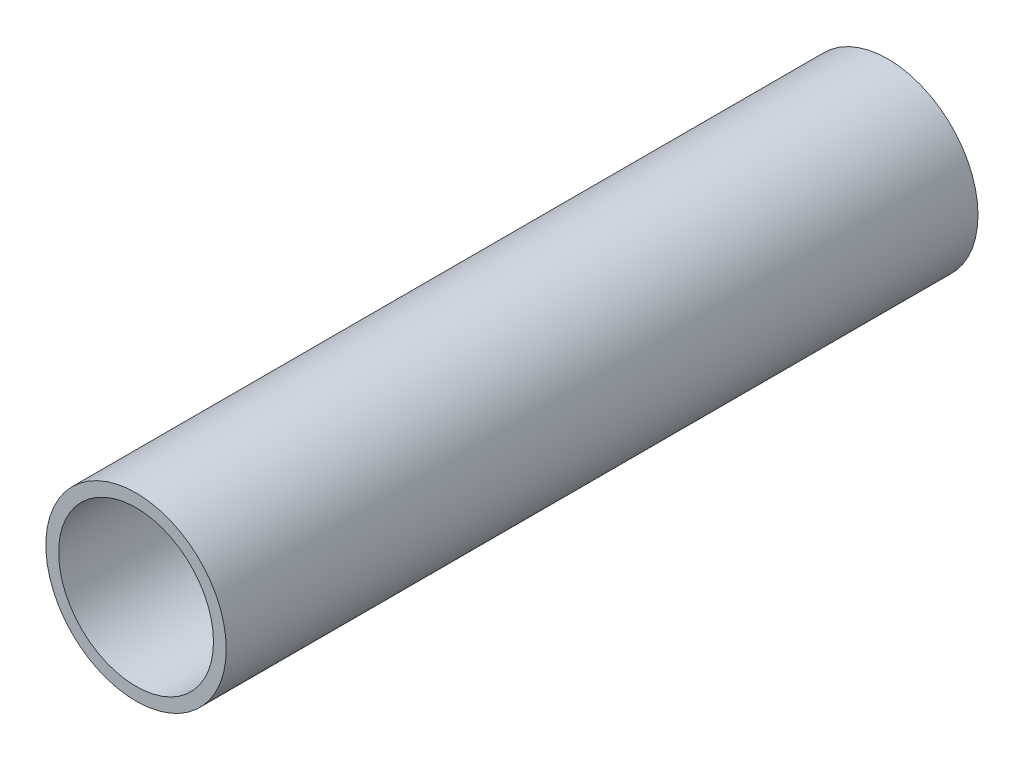
ISO-10303-21;
HEADER;
FILE_DESCRIPTION(('STEP AP214'),'2;1');
FILE_NAME('part.step','',(''),(''),'','','');
FILE_SCHEMA(('AUTOMOTIVE_DESIGN { 1 0 10303 214 1 1 1 1 }'));
ENDSEC;
DATA;
#1=APPLICATION_CONTEXT('core data for automotive mechanical design processes');
#2=APPLICATION_PROTOCOL_DEFINITION('international standard','automotive_design',2000,#1);
#3=PRODUCT_CONTEXT('',#1,'mechanical');
#4=PRODUCT('Part','Part','',(#3));
#5=PRODUCT_RELATED_PRODUCT_CATEGORY('part','',(#4));
#6=PRODUCT_DEFINITION_FORMATION('','',#4);
#7=PRODUCT_DEFINITION_CONTEXT('part definition',#1,'design');
#8=PRODUCT_DEFINITION('design','',#6,#7);
#9=PRODUCT_DEFINITION_SHAPE('','',#8);
#10=(LENGTH_UNIT() NAMED_UNIT(*) SI_UNIT(.MILLI.,.METRE.));
#11=(NAMED_UNIT(*) PLANE_ANGLE_UNIT() SI_UNIT($,.RADIAN.));
#12=(NAMED_UNIT(*) SI_UNIT($,.STERADIAN.) SOLID_ANGLE_UNIT());
#13=UNCERTAINTY_MEASURE_WITH_UNIT(LENGTH_MEASURE(1.E-05),#10,'distance_accuracy_value','');
#14=(GEOMETRIC_REPRESENTATION_CONTEXT(3) GLOBAL_UNCERTAINTY_ASSIGNED_CONTEXT((#13)) GLOBAL_UNIT_ASSIGNED_CONTEXT((#10,
#11,#12)) REPRESENTATION_CONTEXT('',''));
#15=CARTESIAN_POINT('',(0.,0.,0.));
#16=DIRECTION('',(0.,0.,1.));
#17=DIRECTION('',(1.,0.,0.));
#18=AXIS2_PLACEMENT_3D('',#15,#16,#17);
#19=CARTESIAN_POINT('',(0.,0.,-200.));
#20=DIRECTION('',(0.,0.,1.));
#21=DIRECTION('',(1.,0.,0.));
#22=AXIS2_PLACEMENT_3D('',#19,#20,#21);
#23=CYLINDRICAL_SURFACE('',#22,24.);
#24=CARTESIAN_POINT('',(0.,0.,-200.));
#25=DIRECTION('',(0.,0.,1.));
#26=DIRECTION('',(1.,0.,0.));
#27=AXIS2_PLACEMENT_3D('',#24,#25,#26);
#28=CIRCLE('',#27,24.);
#29=CARTESIAN_POINT('',(24.,0.,-200.));
#30=VERTEX_POINT('',#29);
#31=EDGE_CURVE('E10',#30,#30,#28,.T.);
#32=ORIENTED_EDGE('',*,*,#31,.T.);
#33=EDGE_LOOP('',(#32));
#34=FACE_BOUND('',#33,.T.);
#35=CARTESIAN_POINT('',(0.,0.,0.));
#36=DIRECTION('',(0.,0.,1.));
#37=DIRECTION('',(1.,0.,0.));
#38=AXIS2_PLACEMENT_3D('',#35,#36,#37);
#39=CIRCLE('',#38,24.);
#40=CARTESIAN_POINT('',(24.,0.,0.));
#41=VERTEX_POINT('',#40);
#42=EDGE_CURVE('E36',#41,#41,#39,.T.);
#43=ORIENTED_EDGE('',*,*,#42,.F.);
#44=EDGE_LOOP('',(#43));
#45=FACE_BOUND('',#44,.T.);
#46=ADVANCED_FACE('F33',(#34,#45),#23,.T.);
#47=CARTESIAN_POINT('',(0.,0.,-200.));
#48=DIRECTION('',(0.,0.,1.));
#49=DIRECTION('',(1.,0.,0.));
#50=AXIS2_PLACEMENT_3D('',#47,#48,#49);
#51=PLANE('',#50);
#52=CARTESIAN_POINT('',(0.,0.,-200.));
#53=DIRECTION('',(0.,0.,1.));
#54=DIRECTION('',(1.,0.,0.));
#55=AXIS2_PLACEMENT_3D('',#52,#53,#54);
#56=CIRCLE('',#55,20.6);
#57=CARTESIAN_POINT('',(20.6,0.,-200.));
#58=VERTEX_POINT('',#57);
#59=EDGE_CURVE('E43',#58,#58,#56,.T.);
#60=ORIENTED_EDGE('',*,*,#59,.T.);
#61=EDGE_LOOP('',(#60));
#62=FACE_BOUND('',#61,.T.);
#63=ORIENTED_EDGE('',*,*,#31,.F.);
#64=EDGE_LOOP('',(#63));
#65=FACE_BOUND('',#64,.T.);
#66=ADVANCED_FACE('F51',(#62,#65),#51,.F.);
#67=CARTESIAN_POINT('',(0.,0.,0.));
#68=DIRECTION('',(0.,0.,1.));
#69=DIRECTION('',(1.,0.,0.));
#70=AXIS2_PLACEMENT_3D('',#67,#68,#69);
#71=PLANE('',#70);
#72=CARTESIAN_POINT('',(0.,0.,0.));
#73=DIRECTION('',(0.,0.,1.));
#74=DIRECTION('',(1.,0.,0.));
#75=AXIS2_PLACEMENT_3D('',#72,#73,#74);
#76=CIRCLE('',#75,20.6);
#77=CARTESIAN_POINT('',(20.6,0.,0.));
#78=VERTEX_POINT('',#77);
#79=EDGE_CURVE('E45',#78,#78,#76,.T.);
#80=ORIENTED_EDGE('',*,*,#79,.F.);
#81=EDGE_LOOP('',(#80));
#82=FACE_BOUND('',#81,.T.);
#83=ORIENTED_EDGE('',*,*,#42,.T.);
#84=EDGE_LOOP('',(#83));
#85=FACE_BOUND('',#84,.T.);
#86=ADVANCED_FACE('F57',(#82,#85),#71,.T.);
#87=CARTESIAN_POINT('',(0.,0.,-200.));
#88=DIRECTION('',(0.,0.,1.));
#89=DIRECTION('',(1.,0.,0.));
#90=AXIS2_PLACEMENT_3D('',#87,#88,#89);
#91=CYLINDRICAL_SURFACE('',#90,20.6);
#92=ORIENTED_EDGE('',*,*,#59,.F.);
#93=EDGE_LOOP('',(#92));
#94=FACE_BOUND('',#93,.T.);
#95=ORIENTED_EDGE('',*,*,#79,.T.);
#96=EDGE_LOOP('',(#95));
#97=FACE_BOUND('',#96,.T.);
#98=ADVANCED_FACE('F54',(#94,#97),#91,.F.);
#99=CLOSED_SHELL('',(#46,#66,#86,#98));
#100=MANIFOLD_SOLID_BREP('B2',#99);
#101=ADVANCED_BREP_SHAPE_REPRESENTATION('',(#18,#100),#14);
#102=SHAPE_DEFINITION_REPRESENTATION(#9,#101);
ENDSEC;
END-ISO-10303-21;
